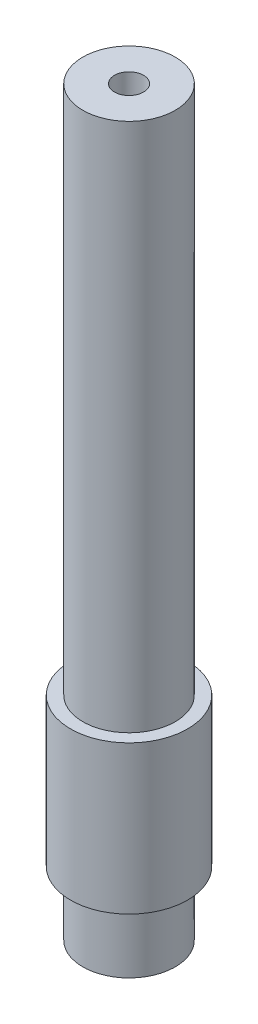
ISO-10303-21;
HEADER;
FILE_DESCRIPTION(('STEP AP214'),'2;1');
FILE_NAME('part.step','',(''),(''),'','','');
FILE_SCHEMA(('AUTOMOTIVE_DESIGN { 1 0 10303 214 1 1 1 1 }'));
ENDSEC;
DATA;
#1=APPLICATION_CONTEXT('core data for automotive mechanical design processes');
#2=APPLICATION_PROTOCOL_DEFINITION('international standard','automotive_design',2000,#1);
#3=PRODUCT_CONTEXT('',#1,'mechanical');
#4=PRODUCT('Part','Part','',(#3));
#5=PRODUCT_RELATED_PRODUCT_CATEGORY('part','',(#4));
#6=PRODUCT_DEFINITION_FORMATION('','',#4);
#7=PRODUCT_DEFINITION_CONTEXT('part definition',#1,'design');
#8=PRODUCT_DEFINITION('design','',#6,#7);
#9=PRODUCT_DEFINITION_SHAPE('','',#8);
#10=(LENGTH_UNIT() NAMED_UNIT(*) SI_UNIT(.MILLI.,.METRE.));
#11=(NAMED_UNIT(*) PLANE_ANGLE_UNIT() SI_UNIT($,.RADIAN.));
#12=(NAMED_UNIT(*) SI_UNIT($,.STERADIAN.) SOLID_ANGLE_UNIT());
#13=UNCERTAINTY_MEASURE_WITH_UNIT(LENGTH_MEASURE(1.E-05),#10,'distance_accuracy_value','');
#14=(GEOMETRIC_REPRESENTATION_CONTEXT(3) GLOBAL_UNCERTAINTY_ASSIGNED_CONTEXT((#13)) GLOBAL_UNIT_ASSIGNED_CONTEXT((#10,
#11,#12)) REPRESENTATION_CONTEXT('',''));
#15=CARTESIAN_POINT('',(0.,0.,0.));
#16=DIRECTION('',(0.,0.,1.));
#17=DIRECTION('',(1.,0.,0.));
#18=AXIS2_PLACEMENT_3D('',#15,#16,#17);
#19=CARTESIAN_POINT('',(0.,-1.09353686139002,0.));
#20=DIRECTION('',(0.,-1.,0.));
#21=DIRECTION('',(0.,0.,-1.));
#22=AXIS2_PLACEMENT_3D('',#19,#20,#21);
#23=CYLINDRICAL_SURFACE('',#22,1.99999999999999);
#24=CARTESIAN_POINT('',(0.,102.,0.));
#25=DIRECTION('',(0.,-1.,0.));
#26=DIRECTION('',(0.,0.,-1.));
#27=AXIS2_PLACEMENT_3D('',#24,#25,#26);
#28=CIRCLE('',#27,2.);
#29=CARTESIAN_POINT('',(0.,102.,-2.));
#30=VERTEX_POINT('',#29);
#31=EDGE_CURVE('E10',#30,#30,#28,.T.);
#32=ORIENTED_EDGE('',*,*,#31,.F.);
#33=EDGE_LOOP('',(#32));
#34=FACE_BOUND('',#33,.T.);
#35=CARTESIAN_POINT('',(0.,0.,0.));
#36=DIRECTION('',(0.,-1.,0.));
#37=DIRECTION('',(0.,0.,-1.));
#38=AXIS2_PLACEMENT_3D('',#35,#36,#37);
#39=CIRCLE('',#38,1.99999999999999);
#40=CARTESIAN_POINT('',(0.,0.,-1.99999999999999));
#41=VERTEX_POINT('',#40);
#42=EDGE_CURVE('E62',#41,#41,#39,.T.);
#43=ORIENTED_EDGE('',*,*,#42,.T.);
#44=EDGE_LOOP('',(#43));
#45=FACE_BOUND('',#44,.T.);
#46=ADVANCED_FACE('F34',(#34,#45),#23,.F.);
#47=CARTESIAN_POINT('',(-6.35,102.,0.));
#48=DIRECTION('',(0.,-1.,0.));
#49=DIRECTION('',(0.,0.,-1.));
#50=AXIS2_PLACEMENT_3D('',#47,#48,#49);
#51=PLANE('',#50);
#52=CARTESIAN_POINT('',(0.,102.,0.));
#53=DIRECTION('',(0.,-1.,0.));
#54=DIRECTION('',(0.,0.,-1.));
#55=AXIS2_PLACEMENT_3D('',#52,#53,#54);
#56=CIRCLE('',#55,6.35);
#57=CARTESIAN_POINT('',(0.,102.,-6.35));
#58=VERTEX_POINT('',#57);
#59=EDGE_CURVE('E40',#58,#58,#56,.T.);
#60=ORIENTED_EDGE('',*,*,#59,.F.);
#61=EDGE_LOOP('',(#60));
#62=FACE_BOUND('',#61,.T.);
#63=ORIENTED_EDGE('',*,*,#31,.T.);
#64=EDGE_LOOP('',(#63));
#65=FACE_BOUND('',#64,.T.);
#66=ADVANCED_FACE('F99',(#62,#65),#51,.F.);
#67=CARTESIAN_POINT('',(0.,-1.09353686139002,0.));
#68=DIRECTION('',(0.,-1.,0.));
#69=DIRECTION('',(0.,0.,-1.));
#70=AXIS2_PLACEMENT_3D('',#67,#68,#69);
#71=CYLINDRICAL_SURFACE('',#70,6.35);
#72=CARTESIAN_POINT('',(0.,29.194600335423,0.));
#73=DIRECTION('',(0.,-1.,0.));
#74=DIRECTION('',(0.,0.,-1.));
#75=AXIS2_PLACEMENT_3D('',#72,#73,#74);
#76=CIRCLE('',#75,6.35);
#77=CARTESIAN_POINT('',(0.,29.194600335423,-6.35));
#78=VERTEX_POINT('',#77);
#79=EDGE_CURVE('E44',#78,#78,#76,.T.);
#80=ORIENTED_EDGE('',*,*,#79,.F.);
#81=EDGE_LOOP('',(#80));
#82=FACE_BOUND('',#81,.T.);
#83=ORIENTED_EDGE('',*,*,#59,.T.);
#84=EDGE_LOOP('',(#83));
#85=FACE_BOUND('',#84,.T.);
#86=ADVANCED_FACE('F94',(#82,#85),#71,.T.);
#87=CARTESIAN_POINT('',(-8.05,29.194600335423,0.));
#88=DIRECTION('',(0.,-1.,0.));
#89=DIRECTION('',(0.,0.,-1.));
#90=AXIS2_PLACEMENT_3D('',#87,#88,#89);
#91=PLANE('',#90);
#92=CARTESIAN_POINT('',(0.,29.194600335423,0.));
#93=DIRECTION('',(0.,-1.,0.));
#94=DIRECTION('',(0.,0.,-1.));
#95=AXIS2_PLACEMENT_3D('',#92,#93,#94);
#96=CIRCLE('',#95,8.05);
#97=CARTESIAN_POINT('',(0.,29.194600335423,-8.05));
#98=VERTEX_POINT('',#97);
#99=EDGE_CURVE('E48',#98,#98,#96,.T.);
#100=ORIENTED_EDGE('',*,*,#99,.F.);
#101=EDGE_LOOP('',(#100));
#102=FACE_BOUND('',#101,.T.);
#103=ORIENTED_EDGE('',*,*,#79,.T.);
#104=EDGE_LOOP('',(#103));
#105=FACE_BOUND('',#104,.T.);
#106=ADVANCED_FACE('F88',(#102,#105),#91,.F.);
#107=CARTESIAN_POINT('',(0.,-1.09353686139002,0.));
#108=DIRECTION('',(0.,-1.,0.));
#109=DIRECTION('',(0.,0.,-1.));
#110=AXIS2_PLACEMENT_3D('',#107,#108,#109);
#111=CYLINDRICAL_SURFACE('',#110,8.05);
#112=CARTESIAN_POINT('',(0.,8.80539966457701,0.));
#113=DIRECTION('',(0.,-1.,0.));
#114=DIRECTION('',(0.,0.,-1.));
#115=AXIS2_PLACEMENT_3D('',#112,#113,#114);
#116=CIRCLE('',#115,8.05);
#117=CARTESIAN_POINT('',(0.,8.80539966457701,-8.05));
#118=VERTEX_POINT('',#117);
#119=EDGE_CURVE('E53',#118,#118,#116,.T.);
#120=ORIENTED_EDGE('',*,*,#119,.F.);
#121=EDGE_LOOP('',(#120));
#122=FACE_BOUND('',#121,.T.);
#123=ORIENTED_EDGE('',*,*,#99,.T.);
#124=EDGE_LOOP('',(#123));
#125=FACE_BOUND('',#124,.T.);
#126=ADVANCED_FACE('F82',(#122,#125),#111,.T.);
#127=CARTESIAN_POINT('',(-6.35,8.80539966457701,0.));
#128=DIRECTION('',(0.,1.,0.));
#129=DIRECTION('',(0.,0.,1.));
#130=AXIS2_PLACEMENT_3D('',#127,#128,#129);
#131=PLANE('',#130);
#132=CARTESIAN_POINT('',(0.,8.80539966457701,0.));
#133=DIRECTION('',(0.,-1.,0.));
#134=DIRECTION('',(0.,0.,-1.));
#135=AXIS2_PLACEMENT_3D('',#132,#133,#134);
#136=CIRCLE('',#135,6.35);
#137=CARTESIAN_POINT('',(0.,8.80539966457701,-6.35));
#138=VERTEX_POINT('',#137);
#139=EDGE_CURVE('E56',#138,#138,#136,.T.);
#140=ORIENTED_EDGE('',*,*,#139,.F.);
#141=EDGE_LOOP('',(#140));
#142=FACE_BOUND('',#141,.T.);
#143=ORIENTED_EDGE('',*,*,#119,.T.);
#144=EDGE_LOOP('',(#143));
#145=FACE_BOUND('',#144,.T.);
#146=ADVANCED_FACE('F76',(#142,#145),#131,.F.);
#147=CARTESIAN_POINT('',(0.,-1.09353686139002,0.));
#148=DIRECTION('',(0.,-1.,0.));
#149=DIRECTION('',(0.,0.,-1.));
#150=AXIS2_PLACEMENT_3D('',#147,#148,#149);
#151=CYLINDRICAL_SURFACE('',#150,6.35);
#152=CARTESIAN_POINT('',(0.,0.,0.));
#153=DIRECTION('',(0.,-1.,0.));
#154=DIRECTION('',(0.,0.,-1.));
#155=AXIS2_PLACEMENT_3D('',#152,#153,#154);
#156=CIRCLE('',#155,6.35);
#157=CARTESIAN_POINT('',(0.,0.,-6.35));
#158=VERTEX_POINT('',#157);
#159=EDGE_CURVE('E59',#158,#158,#156,.T.);
#160=ORIENTED_EDGE('',*,*,#159,.F.);
#161=EDGE_LOOP('',(#160));
#162=FACE_BOUND('',#161,.T.);
#163=ORIENTED_EDGE('',*,*,#139,.T.);
#164=EDGE_LOOP('',(#163));
#165=FACE_BOUND('',#164,.T.);
#166=ADVANCED_FACE('F70',(#162,#165),#151,.T.);
#167=CARTESIAN_POINT('',(-6.35,0.,0.));
#168=DIRECTION('',(0.,1.,0.));
#169=DIRECTION('',(0.,0.,1.));
#170=AXIS2_PLACEMENT_3D('',#167,#168,#169);
#171=PLANE('',#170);
#172=ORIENTED_EDGE('',*,*,#42,.F.);
#173=EDGE_LOOP('',(#172));
#174=FACE_BOUND('',#173,.T.);
#175=ORIENTED_EDGE('',*,*,#159,.T.);
#176=EDGE_LOOP('',(#175));
#177=FACE_BOUND('',#176,.T.);
#178=ADVANCED_FACE('F67',(#174,#177),#171,.F.);
#179=CLOSED_SHELL('',(#46,#66,#86,#106,#126,#146,#166,#178));
#180=MANIFOLD_SOLID_BREP('B2',#179);
#181=ADVANCED_BREP_SHAPE_REPRESENTATION('',(#18,#180),#14);
#182=SHAPE_DEFINITION_REPRESENTATION(#9,#181);
ENDSEC;
END-ISO-10303-21;
